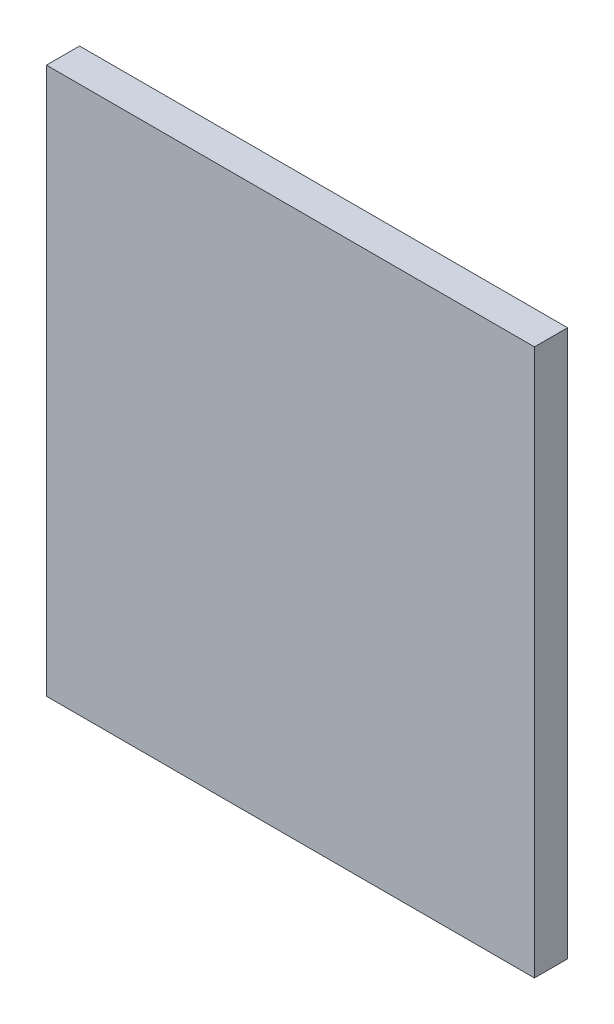
ISO-10303-21;
HEADER;
FILE_DESCRIPTION(('STEP AP214'),'2;1');
FILE_NAME('part.step','',(''),(''),'','','');
FILE_SCHEMA(('AUTOMOTIVE_DESIGN { 1 0 10303 214 1 1 1 1 }'));
ENDSEC;
DATA;
#1=APPLICATION_CONTEXT('core data for automotive mechanical design processes');
#2=APPLICATION_PROTOCOL_DEFINITION('international standard','automotive_design',2000,#1);
#3=PRODUCT_CONTEXT('',#1,'mechanical');
#4=PRODUCT('Part','Part','',(#3));
#5=PRODUCT_RELATED_PRODUCT_CATEGORY('part','',(#4));
#6=PRODUCT_DEFINITION_FORMATION('','',#4);
#7=PRODUCT_DEFINITION_CONTEXT('part definition',#1,'design');
#8=PRODUCT_DEFINITION('design','',#6,#7);
#9=PRODUCT_DEFINITION_SHAPE('','',#8);
#10=(LENGTH_UNIT() NAMED_UNIT(*) SI_UNIT(.MILLI.,.METRE.));
#11=(NAMED_UNIT(*) PLANE_ANGLE_UNIT() SI_UNIT($,.RADIAN.));
#12=(NAMED_UNIT(*) SI_UNIT($,.STERADIAN.) SOLID_ANGLE_UNIT());
#13=UNCERTAINTY_MEASURE_WITH_UNIT(LENGTH_MEASURE(1.E-05),#10,'distance_accuracy_value','');
#14=(GEOMETRIC_REPRESENTATION_CONTEXT(3) GLOBAL_UNCERTAINTY_ASSIGNED_CONTEXT((#13)) GLOBAL_UNIT_ASSIGNED_CONTEXT((#10,
#11,#12)) REPRESENTATION_CONTEXT('',''));
#15=CARTESIAN_POINT('',(0.,0.,0.));
#16=DIRECTION('',(0.,0.,1.));
#17=DIRECTION('',(1.,0.,0.));
#18=AXIS2_PLACEMENT_3D('',#15,#16,#17);
#19=CARTESIAN_POINT('',(1.3554707379135,12.7290839694656,2.));
#20=DIRECTION('',(1.,0.,0.));
#21=DIRECTION('',(0.,1.,0.));
#22=AXIS2_PLACEMENT_3D('',#19,#20,#21);
#23=PLANE('',#22);
#24=DIRECTION('',(0.,-1.,0.));
#25=VECTOR('',#24,1.);
#26=CARTESIAN_POINT('',(1.3554707379135,12.7290839694656,0.));
#27=LINE('',#26,#25);
#28=CARTESIAN_POINT('',(1.3554707379135,12.7290839694656,0.));
#29=VERTEX_POINT('',#28);
#30=CARTESIAN_POINT('',(1.35547073791351,-20.2909160305344,0.));
#31=VERTEX_POINT('',#30);
#32=EDGE_CURVE('E97',#29,#31,#27,.T.);
#33=ORIENTED_EDGE('',*,*,#32,.T.);
#34=DIRECTION('',(0.,0.,-1.));
#35=VECTOR('',#34,1.);
#36=CARTESIAN_POINT('',(1.35547073791351,-20.2909160305344,2.));
#37=LINE('',#36,#35);
#38=CARTESIAN_POINT('',(1.35547073791351,-20.2909160305344,2.));
#39=VERTEX_POINT('',#38);
#40=EDGE_CURVE('E11',#39,#31,#37,.T.);
#41=ORIENTED_EDGE('',*,*,#40,.F.);
#42=DIRECTION('',(0.,-1.,0.));
#43=VECTOR('',#42,1.);
#44=CARTESIAN_POINT('',(1.3554707379135,12.7290839694656,2.));
#45=LINE('',#44,#43);
#46=CARTESIAN_POINT('',(1.3554707379135,12.7290839694656,2.));
#47=VERTEX_POINT('',#46);
#48=EDGE_CURVE('E85',#47,#39,#45,.T.);
#49=ORIENTED_EDGE('',*,*,#48,.F.);
#50=DIRECTION('',(0.,0.,-1.));
#51=VECTOR('',#50,1.);
#52=CARTESIAN_POINT('',(1.3554707379135,12.7290839694656,2.));
#53=LINE('',#52,#51);
#54=EDGE_CURVE('E93',#47,#29,#53,.T.);
#55=ORIENTED_EDGE('',*,*,#54,.T.);
#56=EDGE_LOOP('',(#33,#41,#49,#55));
#57=FACE_BOUND('',#56,.T.);
#58=ADVANCED_FACE('F34',(#57),#23,.F.);
#59=CARTESIAN_POINT('',(1.35547073791351,-20.2909160305344,2.));
#60=DIRECTION('',(0.,1.,0.));
#61=DIRECTION('',(0.,0.,1.));
#62=AXIS2_PLACEMENT_3D('',#59,#60,#61);
#63=PLANE('',#62);
#64=DIRECTION('',(1.,0.,0.));
#65=VECTOR('',#64,1.);
#66=CARTESIAN_POINT('',(1.35547073791351,-20.2909160305344,0.));
#67=LINE('',#66,#65);
#68=CARTESIAN_POINT('',(30.8354707379135,-20.2909160305344,0.));
#69=VERTEX_POINT('',#68);
#70=EDGE_CURVE('E89',#31,#69,#67,.T.);
#71=ORIENTED_EDGE('',*,*,#70,.T.);
#72=DIRECTION('',(0.,0.,-1.));
#73=VECTOR('',#72,1.);
#74=CARTESIAN_POINT('',(30.8354707379135,-20.2909160305344,2.));
#75=LINE('',#74,#73);
#76=CARTESIAN_POINT('',(30.8354707379135,-20.2909160305344,2.));
#77=VERTEX_POINT('',#76);
#78=EDGE_CURVE('E42',#77,#69,#75,.T.);
#79=ORIENTED_EDGE('',*,*,#78,.F.);
#80=DIRECTION('',(1.,0.,0.));
#81=VECTOR('',#80,1.);
#82=CARTESIAN_POINT('',(1.35547073791351,-20.2909160305344,2.));
#83=LINE('',#82,#81);
#84=EDGE_CURVE('E80',#39,#77,#83,.T.);
#85=ORIENTED_EDGE('',*,*,#84,.F.);
#86=ORIENTED_EDGE('',*,*,#40,.T.);
#87=EDGE_LOOP('',(#71,#79,#85,#86));
#88=FACE_BOUND('',#87,.T.);
#89=ADVANCED_FACE('F88',(#88),#63,.F.);
#90=CARTESIAN_POINT('',(30.8354707379135,12.7290839694656,2.));
#91=DIRECTION('',(-1.,0.,0.));
#92=DIRECTION('',(0.,0.,1.));
#93=AXIS2_PLACEMENT_3D('',#90,#91,#92);
#94=PLANE('',#93);
#95=DIRECTION('',(0.,1.,0.));
#96=VECTOR('',#95,1.);
#97=CARTESIAN_POINT('',(30.8354707379135,12.7290839694656,0.));
#98=LINE('',#97,#96);
#99=CARTESIAN_POINT('',(30.8354707379135,12.7290839694656,0.));
#100=VERTEX_POINT('',#99);
#101=EDGE_CURVE('E67',#69,#100,#98,.T.);
#102=ORIENTED_EDGE('',*,*,#101,.T.);
#103=DIRECTION('',(0.,0.,-1.));
#104=VECTOR('',#103,1.);
#105=CARTESIAN_POINT('',(30.8354707379135,12.7290839694656,2.));
#106=LINE('',#105,#104);
#107=CARTESIAN_POINT('',(30.8354707379135,12.7290839694656,2.));
#108=VERTEX_POINT('',#107);
#109=EDGE_CURVE('E90',#108,#100,#106,.T.);
#110=ORIENTED_EDGE('',*,*,#109,.F.);
#111=DIRECTION('',(0.,1.,0.));
#112=VECTOR('',#111,1.);
#113=CARTESIAN_POINT('',(30.8354707379135,12.7290839694656,2.));
#114=LINE('',#113,#112);
#115=EDGE_CURVE('E83',#77,#108,#114,.T.);
#116=ORIENTED_EDGE('',*,*,#115,.F.);
#117=ORIENTED_EDGE('',*,*,#78,.T.);
#118=EDGE_LOOP('',(#102,#110,#116,#117));
#119=FACE_BOUND('',#118,.T.);
#120=ADVANCED_FACE('F91',(#119),#94,.F.);
#121=CARTESIAN_POINT('',(1.3554707379135,12.7290839694656,2.));
#122=DIRECTION('',(0.,-1.,0.));
#123=DIRECTION('',(0.,0.,-1.));
#124=AXIS2_PLACEMENT_3D('',#121,#122,#123);
#125=PLANE('',#124);
#126=DIRECTION('',(-1.,0.,0.));
#127=VECTOR('',#126,1.);
#128=CARTESIAN_POINT('',(1.3554707379135,12.7290839694656,0.));
#129=LINE('',#128,#127);
#130=EDGE_CURVE('E73',#100,#29,#129,.T.);
#131=ORIENTED_EDGE('',*,*,#130,.T.);
#132=ORIENTED_EDGE('',*,*,#54,.F.);
#133=DIRECTION('',(-1.,0.,0.));
#134=VECTOR('',#133,1.);
#135=CARTESIAN_POINT('',(1.3554707379135,12.7290839694656,2.));
#136=LINE('',#135,#134);
#137=EDGE_CURVE('E50',#108,#47,#136,.T.);
#138=ORIENTED_EDGE('',*,*,#137,.F.);
#139=ORIENTED_EDGE('',*,*,#109,.T.);
#140=EDGE_LOOP('',(#131,#132,#138,#139));
#141=FACE_BOUND('',#140,.T.);
#142=ADVANCED_FACE('F104',(#141),#125,.F.);
#143=CARTESIAN_POINT('',(0.,0.,2.));
#144=DIRECTION('',(0.,0.,1.));
#145=DIRECTION('',(1.,0.,0.));
#146=AXIS2_PLACEMENT_3D('',#143,#144,#145);
#147=PLANE('',#146);
#148=ORIENTED_EDGE('',*,*,#48,.T.);
#149=ORIENTED_EDGE('',*,*,#84,.T.);
#150=ORIENTED_EDGE('',*,*,#115,.T.);
#151=ORIENTED_EDGE('',*,*,#137,.T.);
#152=EDGE_LOOP('',(#148,#149,#150,#151));
#153=FACE_BOUND('',#152,.T.);
#154=ADVANCED_FACE('F81',(#153),#147,.T.);
#155=CARTESIAN_POINT('',(0.,0.,0.));
#156=DIRECTION('',(0.,0.,1.));
#157=DIRECTION('',(1.,0.,0.));
#158=AXIS2_PLACEMENT_3D('',#155,#156,#157);
#159=PLANE('',#158);
#160=ORIENTED_EDGE('',*,*,#32,.F.);
#161=ORIENTED_EDGE('',*,*,#130,.F.);
#162=ORIENTED_EDGE('',*,*,#101,.F.);
#163=ORIENTED_EDGE('',*,*,#70,.F.);
#164=EDGE_LOOP('',(#160,#161,#162,#163));
#165=FACE_BOUND('',#164,.T.);
#166=ADVANCED_FACE('F107',(#165),#159,.F.);
#167=CLOSED_SHELL('',(#58,#89,#120,#142,#154,#166));
#168=MANIFOLD_SOLID_BREP('B2',#167);
#169=ADVANCED_BREP_SHAPE_REPRESENTATION('',(#18,#168),#14);
#170=SHAPE_DEFINITION_REPRESENTATION(#9,#169);
ENDSEC;
END-ISO-10303-21;
